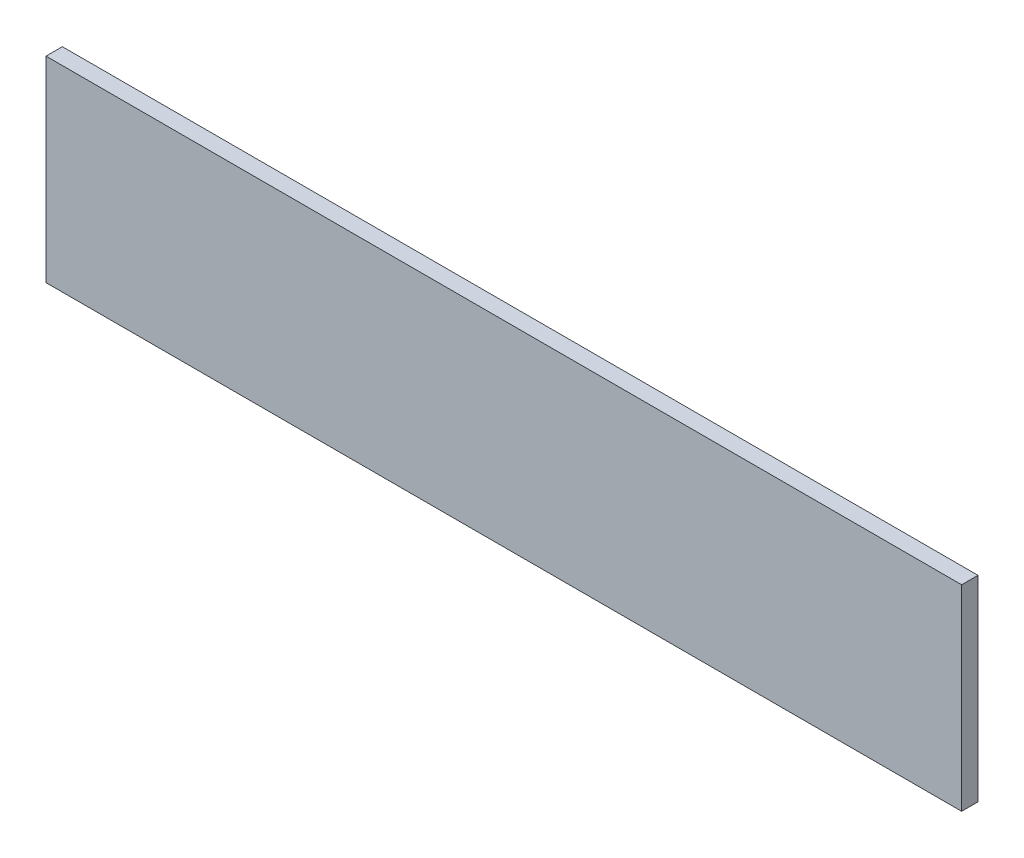
ISO-10303-21;
HEADER;
FILE_DESCRIPTION(('STEP AP214'),'2;1');
FILE_NAME('part.step','',(''),(''),'','','');
FILE_SCHEMA(('AUTOMOTIVE_DESIGN { 1 0 10303 214 1 1 1 1 }'));
ENDSEC;
DATA;
#1=APPLICATION_CONTEXT('core data for automotive mechanical design processes');
#2=APPLICATION_PROTOCOL_DEFINITION('international standard','automotive_design',2000,#1);
#3=PRODUCT_CONTEXT('',#1,'mechanical');
#4=PRODUCT('Part','Part','',(#3));
#5=PRODUCT_RELATED_PRODUCT_CATEGORY('part','',(#4));
#6=PRODUCT_DEFINITION_FORMATION('','',#4);
#7=PRODUCT_DEFINITION_CONTEXT('part definition',#1,'design');
#8=PRODUCT_DEFINITION('design','',#6,#7);
#9=PRODUCT_DEFINITION_SHAPE('','',#8);
#10=(LENGTH_UNIT() NAMED_UNIT(*) SI_UNIT(.MILLI.,.METRE.));
#11=(NAMED_UNIT(*) PLANE_ANGLE_UNIT() SI_UNIT($,.RADIAN.));
#12=(NAMED_UNIT(*) SI_UNIT($,.STERADIAN.) SOLID_ANGLE_UNIT());
#13=UNCERTAINTY_MEASURE_WITH_UNIT(LENGTH_MEASURE(1.E-05),#10,'distance_accuracy_value','');
#14=(GEOMETRIC_REPRESENTATION_CONTEXT(3) GLOBAL_UNCERTAINTY_ASSIGNED_CONTEXT((#13)) GLOBAL_UNIT_ASSIGNED_CONTEXT((#10,
#11,#12)) REPRESENTATION_CONTEXT('',''));
#15=CARTESIAN_POINT('',(0.,0.,0.));
#16=DIRECTION('',(0.,0.,1.));
#17=DIRECTION('',(1.,0.,0.));
#18=AXIS2_PLACEMENT_3D('',#15,#16,#17);
#19=CARTESIAN_POINT('',(355.6,-38.1,-3.175));
#20=DIRECTION('',(0.,0.,1.));
#21=DIRECTION('',(1.,0.,0.));
#22=AXIS2_PLACEMENT_3D('',#19,#20,#21);
#23=PLANE('',#22);
#24=DIRECTION('',(0.,1.,0.));
#25=VECTOR('',#24,1.);
#26=CARTESIAN_POINT('',(0.,-38.1,-3.175));
#27=LINE('',#26,#25);
#28=CARTESIAN_POINT('',(0.,-38.1,-3.175));
#29=VERTEX_POINT('',#28);
#30=CARTESIAN_POINT('',(0.,38.1,-3.175));
#31=VERTEX_POINT('',#30);
#32=EDGE_CURVE('E98',#29,#31,#27,.T.);
#33=ORIENTED_EDGE('',*,*,#32,.T.);
#34=DIRECTION('',(-1.,0.,0.));
#35=VECTOR('',#34,1.);
#36=CARTESIAN_POINT('',(355.6,38.1,-3.175));
#37=LINE('',#36,#35);
#38=CARTESIAN_POINT('',(355.6,38.1,-3.175));
#39=VERTEX_POINT('',#38);
#40=EDGE_CURVE('E11',#39,#31,#37,.T.);
#41=ORIENTED_EDGE('',*,*,#40,.F.);
#42=DIRECTION('',(0.,1.,0.));
#43=VECTOR('',#42,1.);
#44=CARTESIAN_POINT('',(355.6,-38.1,-3.175));
#45=LINE('',#44,#43);
#46=CARTESIAN_POINT('',(355.6,-38.1,-3.175));
#47=VERTEX_POINT('',#46);
#48=EDGE_CURVE('E86',#47,#39,#45,.T.);
#49=ORIENTED_EDGE('',*,*,#48,.F.);
#50=DIRECTION('',(-1.,0.,0.));
#51=VECTOR('',#50,1.);
#52=CARTESIAN_POINT('',(355.6,-38.1,-3.175));
#53=LINE('',#52,#51);
#54=EDGE_CURVE('E94',#47,#29,#53,.T.);
#55=ORIENTED_EDGE('',*,*,#54,.T.);
#56=EDGE_LOOP('',(#33,#41,#49,#55));
#57=FACE_BOUND('',#56,.T.);
#58=ADVANCED_FACE('F35',(#57),#23,.F.);
#59=CARTESIAN_POINT('',(355.6,38.1,3.175));
#60=DIRECTION('',(0.,-1.,0.));
#61=DIRECTION('',(0.,0.,-1.));
#62=AXIS2_PLACEMENT_3D('',#59,#60,#61);
#63=PLANE('',#62);
#64=DIRECTION('',(0.,0.,1.));
#65=VECTOR('',#64,1.);
#66=CARTESIAN_POINT('',(0.,38.1,3.175));
#67=LINE('',#66,#65);
#68=CARTESIAN_POINT('',(0.,38.1,3.175));
#69=VERTEX_POINT('',#68);
#70=EDGE_CURVE('E90',#31,#69,#67,.T.);
#71=ORIENTED_EDGE('',*,*,#70,.T.);
#72=DIRECTION('',(-1.,0.,0.));
#73=VECTOR('',#72,1.);
#74=CARTESIAN_POINT('',(355.6,38.1,3.175));
#75=LINE('',#74,#73);
#76=CARTESIAN_POINT('',(355.6,38.1,3.175));
#77=VERTEX_POINT('',#76);
#78=EDGE_CURVE('E43',#77,#69,#75,.T.);
#79=ORIENTED_EDGE('',*,*,#78,.F.);
#80=DIRECTION('',(0.,0.,1.));
#81=VECTOR('',#80,1.);
#82=CARTESIAN_POINT('',(355.6,38.1,3.175));
#83=LINE('',#82,#81);
#84=EDGE_CURVE('E81',#39,#77,#83,.T.);
#85=ORIENTED_EDGE('',*,*,#84,.F.);
#86=ORIENTED_EDGE('',*,*,#40,.T.);
#87=EDGE_LOOP('',(#71,#79,#85,#86));
#88=FACE_BOUND('',#87,.T.);
#89=ADVANCED_FACE('F89',(#88),#63,.F.);
#90=CARTESIAN_POINT('',(355.6,-38.1,3.175));
#91=DIRECTION('',(0.,0.,-1.));
#92=DIRECTION('',(-1.,0.,0.));
#93=AXIS2_PLACEMENT_3D('',#90,#91,#92);
#94=PLANE('',#93);
#95=DIRECTION('',(0.,-1.,0.));
#96=VECTOR('',#95,1.);
#97=CARTESIAN_POINT('',(0.,-38.1,3.175));
#98=LINE('',#97,#96);
#99=CARTESIAN_POINT('',(0.,-38.1,3.175));
#100=VERTEX_POINT('',#99);
#101=EDGE_CURVE('E68',#69,#100,#98,.T.);
#102=ORIENTED_EDGE('',*,*,#101,.T.);
#103=DIRECTION('',(-1.,0.,0.));
#104=VECTOR('',#103,1.);
#105=CARTESIAN_POINT('',(355.6,-38.1,3.175));
#106=LINE('',#105,#104);
#107=CARTESIAN_POINT('',(355.6,-38.1,3.175));
#108=VERTEX_POINT('',#107);
#109=EDGE_CURVE('E91',#108,#100,#106,.T.);
#110=ORIENTED_EDGE('',*,*,#109,.F.);
#111=DIRECTION('',(0.,-1.,0.));
#112=VECTOR('',#111,1.);
#113=CARTESIAN_POINT('',(355.6,-38.1,3.175));
#114=LINE('',#113,#112);
#115=EDGE_CURVE('E84',#77,#108,#114,.T.);
#116=ORIENTED_EDGE('',*,*,#115,.F.);
#117=ORIENTED_EDGE('',*,*,#78,.T.);
#118=EDGE_LOOP('',(#102,#110,#116,#117));
#119=FACE_BOUND('',#118,.T.);
#120=ADVANCED_FACE('F92',(#119),#94,.F.);
#121=CARTESIAN_POINT('',(355.6,-38.1,3.175));
#122=DIRECTION('',(0.,1.,0.));
#123=DIRECTION('',(0.,0.,1.));
#124=AXIS2_PLACEMENT_3D('',#121,#122,#123);
#125=PLANE('',#124);
#126=DIRECTION('',(0.,0.,-1.));
#127=VECTOR('',#126,1.);
#128=CARTESIAN_POINT('',(0.,-38.1,3.175));
#129=LINE('',#128,#127);
#130=EDGE_CURVE('E74',#100,#29,#129,.T.);
#131=ORIENTED_EDGE('',*,*,#130,.T.);
#132=ORIENTED_EDGE('',*,*,#54,.F.);
#133=DIRECTION('',(0.,0.,-1.));
#134=VECTOR('',#133,1.);
#135=CARTESIAN_POINT('',(355.6,-38.1,3.175));
#136=LINE('',#135,#134);
#137=EDGE_CURVE('E51',#108,#47,#136,.T.);
#138=ORIENTED_EDGE('',*,*,#137,.F.);
#139=ORIENTED_EDGE('',*,*,#109,.T.);
#140=EDGE_LOOP('',(#131,#132,#138,#139));
#141=FACE_BOUND('',#140,.T.);
#142=ADVANCED_FACE('F105',(#141),#125,.F.);
#143=CARTESIAN_POINT('',(355.6,0.,0.));
#144=DIRECTION('',(-1.,0.,0.));
#145=DIRECTION('',(0.,0.,1.));
#146=AXIS2_PLACEMENT_3D('',#143,#144,#145);
#147=PLANE('',#146);
#148=ORIENTED_EDGE('',*,*,#48,.T.);
#149=ORIENTED_EDGE('',*,*,#84,.T.);
#150=ORIENTED_EDGE('',*,*,#115,.T.);
#151=ORIENTED_EDGE('',*,*,#137,.T.);
#152=EDGE_LOOP('',(#148,#149,#150,#151));
#153=FACE_BOUND('',#152,.T.);
#154=ADVANCED_FACE('F82',(#153),#147,.F.);
#155=CARTESIAN_POINT('',(0.,0.,0.));
#156=DIRECTION('',(-1.,0.,0.));
#157=DIRECTION('',(0.,0.,1.));
#158=AXIS2_PLACEMENT_3D('',#155,#156,#157);
#159=PLANE('',#158);
#160=ORIENTED_EDGE('',*,*,#32,.F.);
#161=ORIENTED_EDGE('',*,*,#130,.F.);
#162=ORIENTED_EDGE('',*,*,#101,.F.);
#163=ORIENTED_EDGE('',*,*,#70,.F.);
#164=EDGE_LOOP('',(#160,#161,#162,#163));
#165=FACE_BOUND('',#164,.T.);
#166=ADVANCED_FACE('F108',(#165),#159,.T.);
#167=CLOSED_SHELL('',(#58,#89,#120,#142,#154,#166));
#168=MANIFOLD_SOLID_BREP('B2',#167);
#169=ADVANCED_BREP_SHAPE_REPRESENTATION('',(#18,#168),#14);
#170=SHAPE_DEFINITION_REPRESENTATION(#9,#169);
ENDSEC;
END-ISO-10303-21;
